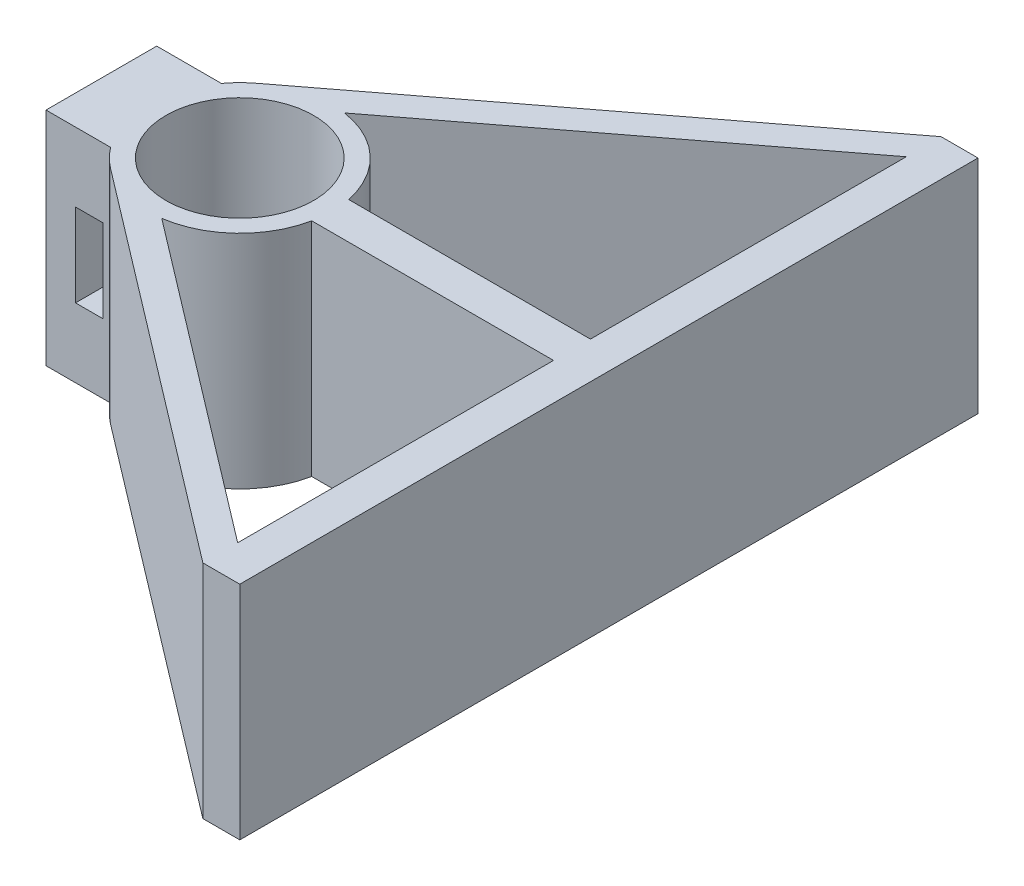
ISO-10303-21;
HEADER;
FILE_DESCRIPTION(('STEP AP214'),'2;1');
FILE_NAME('part.step','',(''),(''),'','','');
FILE_SCHEMA(('AUTOMOTIVE_DESIGN { 1 0 10303 214 1 1 1 1 }'));
ENDSEC;
DATA;
#1=APPLICATION_CONTEXT('core data for automotive mechanical design processes');
#2=APPLICATION_PROTOCOL_DEFINITION('international standard','automotive_design',2000,#1);
#3=PRODUCT_CONTEXT('',#1,'mechanical');
#4=PRODUCT('Part','Part','',(#3));
#5=PRODUCT_RELATED_PRODUCT_CATEGORY('part','',(#4));
#6=PRODUCT_DEFINITION_FORMATION('','',#4);
#7=PRODUCT_DEFINITION_CONTEXT('part definition',#1,'design');
#8=PRODUCT_DEFINITION('design','',#6,#7);
#9=PRODUCT_DEFINITION_SHAPE('','',#8);
#10=(LENGTH_UNIT() NAMED_UNIT(*) SI_UNIT(.MILLI.,.METRE.));
#11=(NAMED_UNIT(*) PLANE_ANGLE_UNIT() SI_UNIT($,.RADIAN.));
#12=(NAMED_UNIT(*) SI_UNIT($,.STERADIAN.) SOLID_ANGLE_UNIT());
#13=UNCERTAINTY_MEASURE_WITH_UNIT(LENGTH_MEASURE(1.E-05),#10,'distance_accuracy_value','');
#14=(GEOMETRIC_REPRESENTATION_CONTEXT(3) GLOBAL_UNCERTAINTY_ASSIGNED_CONTEXT((#13)) GLOBAL_UNIT_ASSIGNED_CONTEXT((#10,
#11,#12)) REPRESENTATION_CONTEXT('',''));
#15=CARTESIAN_POINT('',(0.,0.,0.));
#16=DIRECTION('',(0.,0.,1.));
#17=DIRECTION('',(1.,0.,0.));
#18=AXIS2_PLACEMENT_3D('',#15,#16,#17);
#19=CARTESIAN_POINT('',(0.,-6.,0.));
#20=DIRECTION('',(0.,1.,0.));
#21=DIRECTION('',(0.,0.,1.));
#22=AXIS2_PLACEMENT_3D('',#19,#20,#21);
#23=CYLINDRICAL_SURFACE('',#22,5.);
#24=DIRECTION('',(0.,1.,0.));
#25=VECTOR('',#24,1.);
#26=CARTESIAN_POINT('',(-4.,-6.,-3.));
#27=LINE('',#26,#25);
#28=CARTESIAN_POINT('',(-4.,-6.,-3.));
#29=VERTEX_POINT('',#28);
#30=CARTESIAN_POINT('',(-4.,6.,-3.));
#31=VERTEX_POINT('',#30);
#32=EDGE_CURVE('E42',#29,#31,#27,.T.);
#33=ORIENTED_EDGE('',*,*,#32,.T.);
#34=CARTESIAN_POINT('',(0.,6.,0.));
#35=DIRECTION('',(0.,1.,0.));
#36=DIRECTION('',(0.,0.,1.));
#37=AXIS2_PLACEMENT_3D('',#34,#35,#36);
#38=CIRCLE('',#37,5.);
#39=CARTESIAN_POINT('',(-3.03019449348129,6.,-3.97717504413316));
#40=VERTEX_POINT('',#39);
#41=EDGE_CURVE('E271',#40,#31,#38,.T.);
#42=ORIENTED_EDGE('',*,*,#41,.F.);
#43=DIRECTION('',(0.,1.,0.));
#44=VECTOR('',#43,1.);
#45=CARTESIAN_POINT('',(-3.03019449348129,-6.,-3.97717504413316));
#46=LINE('',#45,#44);
#47=CARTESIAN_POINT('',(-3.03019449348129,-6.,-3.97717504413316));
#48=VERTEX_POINT('',#47);
#49=EDGE_CURVE('E11',#48,#40,#46,.T.);
#50=ORIENTED_EDGE('',*,*,#49,.F.);
#51=CARTESIAN_POINT('',(0.,-6.,0.));
#52=DIRECTION('',(0.,1.,0.));
#53=DIRECTION('',(0.,0.,1.));
#54=AXIS2_PLACEMENT_3D('',#51,#52,#53);
#55=CIRCLE('',#54,5.);
#56=EDGE_CURVE('E371',#48,#29,#55,.T.);
#57=ORIENTED_EDGE('',*,*,#56,.T.);
#58=EDGE_LOOP('',(#33,#42,#50,#57));
#59=FACE_BOUND('',#58,.T.);
#60=ADVANCED_FACE('F39',(#59),#23,.T.);
#61=CARTESIAN_POINT('',(18.,-6.,-20.));
#62=DIRECTION('',(-0.606038898696259,0.,-0.795435008826633));
#63=DIRECTION('',(-0.795435008826633,0.,0.606038898696259));
#64=AXIS2_PLACEMENT_3D('',#61,#62,#63);
#65=PLANE('',#64);
#66=ORIENTED_EDGE('',*,*,#49,.T.);
#67=DIRECTION('',(-0.795435008826633,0.,0.606038898696259));
#68=VECTOR('',#67,1.);
#69=CARTESIAN_POINT('',(18.,6.,-20.));
#70=LINE('',#69,#68);
#71=CARTESIAN_POINT('',(18.,6.,-20.));
#72=VERTEX_POINT('',#71);
#73=EDGE_CURVE('E307',#72,#40,#70,.T.);
#74=ORIENTED_EDGE('',*,*,#73,.F.);
#75=DIRECTION('',(0.,1.,0.));
#76=VECTOR('',#75,1.);
#77=CARTESIAN_POINT('',(18.,-6.,-20.));
#78=LINE('',#77,#76);
#79=CARTESIAN_POINT('',(18.,-6.,-20.));
#80=VERTEX_POINT('',#79);
#81=EDGE_CURVE('E48',#80,#72,#78,.T.);
#82=ORIENTED_EDGE('',*,*,#81,.F.);
#83=DIRECTION('',(-0.795435008826633,0.,0.606038898696259));
#84=VECTOR('',#83,1.);
#85=CARTESIAN_POINT('',(18.,-6.,-20.));
#86=LINE('',#85,#84);
#87=EDGE_CURVE('E406',#80,#48,#86,.T.);
#88=ORIENTED_EDGE('',*,*,#87,.T.);
#89=EDGE_LOOP('',(#66,#74,#82,#88));
#90=FACE_BOUND('',#89,.T.);
#91=ADVANCED_FACE('F444',(#90),#65,.T.);
#92=CARTESIAN_POINT('',(20.,-6.,-20.));
#93=DIRECTION('',(0.,0.,-1.));
#94=DIRECTION('',(-1.,0.,0.));
#95=AXIS2_PLACEMENT_3D('',#92,#93,#94);
#96=PLANE('',#95);
#97=ORIENTED_EDGE('',*,*,#81,.T.);
#98=DIRECTION('',(-1.,0.,0.));
#99=VECTOR('',#98,1.);
#100=CARTESIAN_POINT('',(20.,6.,-20.));
#101=LINE('',#100,#99);
#102=CARTESIAN_POINT('',(20.,6.,-20.));
#103=VERTEX_POINT('',#102);
#104=EDGE_CURVE('E303',#103,#72,#101,.T.);
#105=ORIENTED_EDGE('',*,*,#104,.F.);
#106=DIRECTION('',(0.,1.,0.));
#107=VECTOR('',#106,1.);
#108=CARTESIAN_POINT('',(20.,-6.,-20.));
#109=LINE('',#108,#107);
#110=CARTESIAN_POINT('',(20.,-6.,-20.));
#111=VERTEX_POINT('',#110);
#112=EDGE_CURVE('E412',#111,#103,#109,.T.);
#113=ORIENTED_EDGE('',*,*,#112,.F.);
#114=DIRECTION('',(-1.,0.,0.));
#115=VECTOR('',#114,1.);
#116=CARTESIAN_POINT('',(20.,-6.,-20.));
#117=LINE('',#116,#115);
#118=EDGE_CURVE('E402',#111,#80,#117,.T.);
#119=ORIENTED_EDGE('',*,*,#118,.T.);
#120=EDGE_LOOP('',(#97,#105,#113,#119));
#121=FACE_BOUND('',#120,.T.);
#122=ADVANCED_FACE('F474',(#121),#96,.T.);
#123=CARTESIAN_POINT('',(20.,-6.,1.90555236810274));
#124=DIRECTION('',(1.,0.,0.));
#125=DIRECTION('',(0.,0.,-1.));
#126=AXIS2_PLACEMENT_3D('',#123,#124,#125);
#127=PLANE('',#126);
#128=ORIENTED_EDGE('',*,*,#112,.T.);
#129=DIRECTION('',(0.,0.,-1.));
#130=VECTOR('',#129,1.);
#131=CARTESIAN_POINT('',(20.,6.,1.90555236810274));
#132=LINE('',#131,#130);
#133=CARTESIAN_POINT('',(20.,6.,20.));
#134=VERTEX_POINT('',#133);
#135=EDGE_CURVE('E299',#134,#103,#132,.T.);
#136=ORIENTED_EDGE('',*,*,#135,.F.);
#137=DIRECTION('',(0.,1.,0.));
#138=VECTOR('',#137,1.);
#139=CARTESIAN_POINT('',(20.,-6.,20.));
#140=LINE('',#139,#138);
#141=CARTESIAN_POINT('',(20.,-6.,20.));
#142=VERTEX_POINT('',#141);
#143=EDGE_CURVE('E415',#142,#134,#140,.T.);
#144=ORIENTED_EDGE('',*,*,#143,.F.);
#145=DIRECTION('',(0.,0.,-1.));
#146=VECTOR('',#145,1.);
#147=CARTESIAN_POINT('',(20.,-6.,1.90555236810274));
#148=LINE('',#147,#146);
#149=EDGE_CURVE('E399',#142,#111,#148,.T.);
#150=ORIENTED_EDGE('',*,*,#149,.T.);
#151=EDGE_LOOP('',(#128,#136,#144,#150));
#152=FACE_BOUND('',#151,.T.);
#153=ADVANCED_FACE('F471',(#152),#127,.T.);
#154=CARTESIAN_POINT('',(20.,-6.,20.));
#155=DIRECTION('',(0.,0.,1.));
#156=DIRECTION('',(1.,0.,0.));
#157=AXIS2_PLACEMENT_3D('',#154,#155,#156);
#158=PLANE('',#157);
#159=ORIENTED_EDGE('',*,*,#143,.T.);
#160=DIRECTION('',(1.,0.,0.));
#161=VECTOR('',#160,1.);
#162=CARTESIAN_POINT('',(20.,6.,20.));
#163=LINE('',#162,#161);
#164=CARTESIAN_POINT('',(18.,6.,20.));
#165=VERTEX_POINT('',#164);
#166=EDGE_CURVE('E295',#165,#134,#163,.T.);
#167=ORIENTED_EDGE('',*,*,#166,.F.);
#168=DIRECTION('',(0.,1.,0.));
#169=VECTOR('',#168,1.);
#170=CARTESIAN_POINT('',(18.,-6.,20.));
#171=LINE('',#170,#169);
#172=CARTESIAN_POINT('',(18.,-6.,20.));
#173=VERTEX_POINT('',#172);
#174=EDGE_CURVE('E418',#173,#165,#171,.T.);
#175=ORIENTED_EDGE('',*,*,#174,.F.);
#176=DIRECTION('',(1.,0.,0.));
#177=VECTOR('',#176,1.);
#178=CARTESIAN_POINT('',(20.,-6.,20.));
#179=LINE('',#178,#177);
#180=EDGE_CURVE('E395',#173,#142,#179,.T.);
#181=ORIENTED_EDGE('',*,*,#180,.T.);
#182=EDGE_LOOP('',(#159,#167,#175,#181));
#183=FACE_BOUND('',#182,.T.);
#184=ADVANCED_FACE('F469',(#183),#158,.T.);
#185=CARTESIAN_POINT('',(18.,-6.,20.));
#186=DIRECTION('',(-0.606038898696259,0.,0.795435008826633));
#187=DIRECTION('',(0.795435008826633,0.,0.606038898696259));
#188=AXIS2_PLACEMENT_3D('',#185,#186,#187);
#189=PLANE('',#188);
#190=ORIENTED_EDGE('',*,*,#174,.T.);
#191=DIRECTION('',(0.795435008826633,0.,0.606038898696259));
#192=VECTOR('',#191,1.);
#193=CARTESIAN_POINT('',(18.,6.,20.));
#194=LINE('',#193,#192);
#195=CARTESIAN_POINT('',(-3.03019449348129,6.,3.97717504413316));
#196=VERTEX_POINT('',#195);
#197=EDGE_CURVE('E291',#196,#165,#194,.T.);
#198=ORIENTED_EDGE('',*,*,#197,.F.);
#199=DIRECTION('',(0.,1.,0.));
#200=VECTOR('',#199,1.);
#201=CARTESIAN_POINT('',(-3.03019449348129,-6.,3.97717504413316));
#202=LINE('',#201,#200);
#203=CARTESIAN_POINT('',(-3.03019449348129,-6.,3.97717504413316));
#204=VERTEX_POINT('',#203);
#205=EDGE_CURVE('E421',#204,#196,#202,.T.);
#206=ORIENTED_EDGE('',*,*,#205,.F.);
#207=DIRECTION('',(0.795435008826633,0.,0.606038898696259));
#208=VECTOR('',#207,1.);
#209=CARTESIAN_POINT('',(18.,-6.,20.));
#210=LINE('',#209,#208);
#211=EDGE_CURVE('E391',#204,#173,#210,.T.);
#212=ORIENTED_EDGE('',*,*,#211,.T.);
#213=EDGE_LOOP('',(#190,#198,#206,#212));
#214=FACE_BOUND('',#213,.T.);
#215=ADVANCED_FACE('F464',(#214),#189,.T.);
#216=CARTESIAN_POINT('',(0.,-6.,0.));
#217=DIRECTION('',(0.,1.,0.));
#218=DIRECTION('',(0.,0.,1.));
#219=AXIS2_PLACEMENT_3D('',#216,#217,#218);
#220=CYLINDRICAL_SURFACE('',#219,5.);
#221=ORIENTED_EDGE('',*,*,#205,.T.);
#222=CARTESIAN_POINT('',(0.,6.,0.));
#223=DIRECTION('',(0.,1.,0.));
#224=DIRECTION('',(0.,0.,1.));
#225=AXIS2_PLACEMENT_3D('',#222,#223,#224);
#226=CIRCLE('',#225,5.);
#227=CARTESIAN_POINT('',(-4.,6.,3.));
#228=VERTEX_POINT('',#227);
#229=EDGE_CURVE('E287',#228,#196,#226,.T.);
#230=ORIENTED_EDGE('',*,*,#229,.F.);
#231=DIRECTION('',(0.,1.,0.));
#232=VECTOR('',#231,1.);
#233=CARTESIAN_POINT('',(-4.,-6.,3.));
#234=LINE('',#233,#232);
#235=CARTESIAN_POINT('',(-4.,-6.,3.));
#236=VERTEX_POINT('',#235);
#237=EDGE_CURVE('E424',#236,#228,#234,.T.);
#238=ORIENTED_EDGE('',*,*,#237,.F.);
#239=CARTESIAN_POINT('',(0.,-6.,0.));
#240=DIRECTION('',(0.,1.,0.));
#241=DIRECTION('',(0.,0.,1.));
#242=AXIS2_PLACEMENT_3D('',#239,#240,#241);
#243=CIRCLE('',#242,5.);
#244=EDGE_CURVE('E387',#236,#204,#243,.T.);
#245=ORIENTED_EDGE('',*,*,#244,.T.);
#246=EDGE_LOOP('',(#221,#230,#238,#245));
#247=FACE_BOUND('',#246,.T.);
#248=ADVANCED_FACE('F459',(#247),#220,.T.);
#249=CARTESIAN_POINT('',(-4.,-6.,3.));
#250=DIRECTION('',(0.,0.,1.));
#251=DIRECTION('',(1.,0.,0.));
#252=AXIS2_PLACEMENT_3D('',#249,#250,#251);
#253=PLANE('',#252);
#254=DIRECTION('',(-1.,0.,0.));
#255=VECTOR('',#254,1.);
#256=CARTESIAN_POINT('',(-4.,2.25,3.));
#257=LINE('',#256,#255);
#258=CARTESIAN_POINT('',(-4.4,2.25,3.));
#259=VERTEX_POINT('',#258);
#260=CARTESIAN_POINT('',(-5.9,2.25,3.));
#261=VERTEX_POINT('',#260);
#262=EDGE_CURVE('E232',#259,#261,#257,.T.);
#263=ORIENTED_EDGE('',*,*,#262,.F.);
#264=DIRECTION('',(0.,1.,0.));
#265=VECTOR('',#264,1.);
#266=CARTESIAN_POINT('',(-4.4,-6.,3.));
#267=LINE('',#266,#265);
#268=CARTESIAN_POINT('',(-4.4,-2.25,3.));
#269=VERTEX_POINT('',#268);
#270=EDGE_CURVE('E220',#269,#259,#267,.T.);
#271=ORIENTED_EDGE('',*,*,#270,.F.);
#272=DIRECTION('',(1.,0.,0.));
#273=VECTOR('',#272,1.);
#274=CARTESIAN_POINT('',(-4.,-2.25,3.));
#275=LINE('',#274,#273);
#276=CARTESIAN_POINT('',(-5.9,-2.25,3.));
#277=VERTEX_POINT('',#276);
#278=EDGE_CURVE('E195',#277,#269,#275,.T.);
#279=ORIENTED_EDGE('',*,*,#278,.F.);
#280=DIRECTION('',(0.,-1.,0.));
#281=VECTOR('',#280,1.);
#282=CARTESIAN_POINT('',(-5.9,-6.,3.));
#283=LINE('',#282,#281);
#284=EDGE_CURVE('E229',#261,#277,#283,.T.);
#285=ORIENTED_EDGE('',*,*,#284,.F.);
#286=EDGE_LOOP('',(#263,#271,#279,#285));
#287=FACE_BOUND('',#286,.T.);
#288=ORIENTED_EDGE('',*,*,#237,.T.);
#289=DIRECTION('',(1.,0.,0.));
#290=VECTOR('',#289,1.);
#291=CARTESIAN_POINT('',(-4.,6.,3.));
#292=LINE('',#291,#290);
#293=CARTESIAN_POINT('',(-7.5,6.,3.));
#294=VERTEX_POINT('',#293);
#295=EDGE_CURVE('E283',#294,#228,#292,.T.);
#296=ORIENTED_EDGE('',*,*,#295,.F.);
#297=DIRECTION('',(0.,1.,0.));
#298=VECTOR('',#297,1.);
#299=CARTESIAN_POINT('',(-7.5,-6.,3.));
#300=LINE('',#299,#298);
#301=CARTESIAN_POINT('',(-7.5,-6.,3.));
#302=VERTEX_POINT('',#301);
#303=EDGE_CURVE('E427',#302,#294,#300,.T.);
#304=ORIENTED_EDGE('',*,*,#303,.F.);
#305=DIRECTION('',(1.,0.,0.));
#306=VECTOR('',#305,1.);
#307=CARTESIAN_POINT('',(-4.,-6.,3.));
#308=LINE('',#307,#306);
#309=EDGE_CURVE('E383',#302,#236,#308,.T.);
#310=ORIENTED_EDGE('',*,*,#309,.T.);
#311=EDGE_LOOP('',(#288,#296,#304,#310));
#312=FACE_BOUND('',#311,.T.);
#313=ADVANCED_FACE('F457',(#287,#312),#253,.T.);
#314=CARTESIAN_POINT('',(-7.5,-6.,-3.));
#315=DIRECTION('',(-1.,0.,0.));
#316=DIRECTION('',(0.,0.,1.));
#317=AXIS2_PLACEMENT_3D('',#314,#315,#316);
#318=PLANE('',#317);
#319=ORIENTED_EDGE('',*,*,#303,.T.);
#320=DIRECTION('',(0.,0.,1.));
#321=VECTOR('',#320,1.);
#322=CARTESIAN_POINT('',(-7.5,6.,-3.));
#323=LINE('',#322,#321);
#324=CARTESIAN_POINT('',(-7.5,6.,-3.));
#325=VERTEX_POINT('',#324);
#326=EDGE_CURVE('E279',#325,#294,#323,.T.);
#327=ORIENTED_EDGE('',*,*,#326,.F.);
#328=DIRECTION('',(0.,1.,0.));
#329=VECTOR('',#328,1.);
#330=CARTESIAN_POINT('',(-7.5,-6.,-3.));
#331=LINE('',#330,#329);
#332=CARTESIAN_POINT('',(-7.5,-6.,-3.));
#333=VERTEX_POINT('',#332);
#334=EDGE_CURVE('E429',#333,#325,#331,.T.);
#335=ORIENTED_EDGE('',*,*,#334,.F.);
#336=DIRECTION('',(0.,0.,1.));
#337=VECTOR('',#336,1.);
#338=CARTESIAN_POINT('',(-7.5,-6.,-3.));
#339=LINE('',#338,#337);
#340=EDGE_CURVE('E379',#333,#302,#339,.T.);
#341=ORIENTED_EDGE('',*,*,#340,.T.);
#342=EDGE_LOOP('',(#319,#327,#335,#341));
#343=FACE_BOUND('',#342,.T.);
#344=ADVANCED_FACE('F453',(#343),#318,.T.);
#345=CARTESIAN_POINT('',(-4.,-6.,-3.));
#346=DIRECTION('',(0.,0.,-1.));
#347=DIRECTION('',(-1.,0.,0.));
#348=AXIS2_PLACEMENT_3D('',#345,#346,#347);
#349=PLANE('',#348);
#350=DIRECTION('',(1.,0.,0.));
#351=VECTOR('',#350,1.);
#352=CARTESIAN_POINT('',(-4.4,2.25,-3.));
#353=LINE('',#352,#351);
#354=CARTESIAN_POINT('',(-5.9,2.25,-3.));
#355=VERTEX_POINT('',#354);
#356=CARTESIAN_POINT('',(-4.4,2.25,-3.));
#357=VERTEX_POINT('',#356);
#358=EDGE_CURVE('E64',#355,#357,#353,.T.);
#359=ORIENTED_EDGE('',*,*,#358,.F.);
#360=DIRECTION('',(0.,1.,0.));
#361=VECTOR('',#360,1.);
#362=CARTESIAN_POINT('',(-5.9,2.25,-3.));
#363=LINE('',#362,#361);
#364=CARTESIAN_POINT('',(-5.9,-2.25,-3.));
#365=VERTEX_POINT('',#364);
#366=EDGE_CURVE('E210',#365,#355,#363,.T.);
#367=ORIENTED_EDGE('',*,*,#366,.F.);
#368=DIRECTION('',(-1.,0.,0.));
#369=VECTOR('',#368,1.);
#370=CARTESIAN_POINT('',(-4.4,-2.25,-3.));
#371=LINE('',#370,#369);
#372=CARTESIAN_POINT('',(-4.4,-2.25,-3.));
#373=VERTEX_POINT('',#372);
#374=EDGE_CURVE('E192',#373,#365,#371,.T.);
#375=ORIENTED_EDGE('',*,*,#374,.F.);
#376=DIRECTION('',(0.,-1.,0.));
#377=VECTOR('',#376,1.);
#378=CARTESIAN_POINT('',(-4.4,-2.25,-3.));
#379=LINE('',#378,#377);
#380=EDGE_CURVE('E202',#357,#373,#379,.T.);
#381=ORIENTED_EDGE('',*,*,#380,.F.);
#382=EDGE_LOOP('',(#359,#367,#375,#381));
#383=FACE_BOUND('',#382,.T.);
#384=ORIENTED_EDGE('',*,*,#334,.T.);
#385=DIRECTION('',(-1.,0.,0.));
#386=VECTOR('',#385,1.);
#387=CARTESIAN_POINT('',(-4.,6.,-3.));
#388=LINE('',#387,#386);
#389=EDGE_CURVE('E275',#31,#325,#388,.T.);
#390=ORIENTED_EDGE('',*,*,#389,.F.);
#391=ORIENTED_EDGE('',*,*,#32,.F.);
#392=DIRECTION('',(-1.,0.,0.));
#393=VECTOR('',#392,1.);
#394=CARTESIAN_POINT('',(-4.,-6.,-3.));
#395=LINE('',#394,#393);
#396=EDGE_CURVE('E375',#29,#333,#395,.T.);
#397=ORIENTED_EDGE('',*,*,#396,.T.);
#398=EDGE_LOOP('',(#384,#390,#391,#397));
#399=FACE_BOUND('',#398,.T.);
#400=ADVANCED_FACE('F207',(#383,#399),#349,.T.);
#401=CARTESIAN_POINT('',(0.,-6.,0.));
#402=DIRECTION('',(0.,1.,0.));
#403=DIRECTION('',(0.,0.,1.));
#404=AXIS2_PLACEMENT_3D('',#401,#402,#403);
#405=PLANE('',#404);
#406=DIRECTION('',(-1.,0.,0.));
#407=VECTOR('',#406,1.);
#408=CARTESIAN_POINT('',(4.89897948556636,-6.,0.999999999999999));
#409=LINE('',#408,#407);
#410=CARTESIAN_POINT('',(18.,-6.,1.));
#411=VERTEX_POINT('',#410);
#412=CARTESIAN_POINT('',(4.89897948556636,-6.,0.999999999999999));
#413=VERTEX_POINT('',#412);
#414=EDGE_CURVE('E323',#411,#413,#409,.T.);
#415=ORIENTED_EDGE('',*,*,#414,.T.);
#416=CARTESIAN_POINT('',(0.,-6.,0.));
#417=DIRECTION('',(0.,-1.,0.));
#418=DIRECTION('',(0.,0.,1.));
#419=AXIS2_PLACEMENT_3D('',#416,#417,#418);
#420=CIRCLE('',#419,5.);
#421=CARTESIAN_POINT('',(0.719134947109476,-6.,4.94801424086935));
#422=VERTEX_POINT('',#421);
#423=EDGE_CURVE('E311',#413,#422,#420,.T.);
#424=ORIENTED_EDGE('',*,*,#423,.T.);
#425=DIRECTION('',(0.795435008826633,0.,0.606038898696259));
#426=VECTOR('',#425,1.);
#427=CARTESIAN_POINT('',(18.,-6.,18.1142393993788));
#428=LINE('',#427,#426);
#429=CARTESIAN_POINT('',(18.,-6.,18.1142393993789));
#430=VERTEX_POINT('',#429);
#431=EDGE_CURVE('E315',#422,#430,#428,.T.);
#432=ORIENTED_EDGE('',*,*,#431,.T.);
#433=DIRECTION('',(0.,0.,-1.));
#434=VECTOR('',#433,1.);
#435=CARTESIAN_POINT('',(18.,-6.,1.));
#436=LINE('',#435,#434);
#437=EDGE_CURVE('E319',#430,#411,#436,.T.);
#438=ORIENTED_EDGE('',*,*,#437,.T.);
#439=EDGE_LOOP('',(#415,#424,#432,#438));
#440=FACE_BOUND('',#439,.T.);
#441=DIRECTION('',(-0.795435008826633,0.,0.606038898696259));
#442=VECTOR('',#441,1.);
#443=CARTESIAN_POINT('',(18.,-6.,-18.1142393993789));
#444=LINE('',#443,#442);
#445=CARTESIAN_POINT('',(18.,-6.,-18.1142393993789));
#446=VERTEX_POINT('',#445);
#447=CARTESIAN_POINT('',(0.719134947109474,-6.,-4.94801424086935));
#448=VERTEX_POINT('',#447);
#449=EDGE_CURVE('E351',#446,#448,#444,.T.);
#450=ORIENTED_EDGE('',*,*,#449,.T.);
#451=CARTESIAN_POINT('',(0.,-6.,0.));
#452=DIRECTION('',(0.,-1.,0.));
#453=DIRECTION('',(0.,0.,1.));
#454=AXIS2_PLACEMENT_3D('',#451,#452,#453);
#455=CIRCLE('',#454,5.);
#456=CARTESIAN_POINT('',(4.89897948556636,-6.,-1.));
#457=VERTEX_POINT('',#456);
#458=EDGE_CURVE('E331',#448,#457,#455,.T.);
#459=ORIENTED_EDGE('',*,*,#458,.T.);
#460=DIRECTION('',(1.,0.,0.));
#461=VECTOR('',#460,1.);
#462=CARTESIAN_POINT('',(4.89897948556636,-6.,-1.));
#463=LINE('',#462,#461);
#464=CARTESIAN_POINT('',(18.,-6.,-1.));
#465=VERTEX_POINT('',#464);
#466=EDGE_CURVE('E343',#457,#465,#463,.T.);
#467=ORIENTED_EDGE('',*,*,#466,.T.);
#468=DIRECTION('',(0.,0.,-1.));
#469=VECTOR('',#468,1.);
#470=CARTESIAN_POINT('',(18.,-6.,-1.));
#471=LINE('',#470,#469);
#472=EDGE_CURVE('E347',#465,#446,#471,.T.);
#473=ORIENTED_EDGE('',*,*,#472,.T.);
#474=EDGE_LOOP('',(#450,#459,#467,#473));
#475=FACE_BOUND('',#474,.T.);
#476=CARTESIAN_POINT('',(0.,-6.,0.));
#477=DIRECTION('',(0.,1.,0.));
#478=DIRECTION('',(0.,0.,1.));
#479=AXIS2_PLACEMENT_3D('',#476,#477,#478);
#480=CIRCLE('',#479,4.);
#481=CARTESIAN_POINT('',(0.,-6.,4.));
#482=VERTEX_POINT('',#481);
#483=EDGE_CURVE('E359',#482,#482,#480,.T.);
#484=ORIENTED_EDGE('',*,*,#483,.T.);
#485=EDGE_LOOP('',(#484));
#486=FACE_BOUND('',#485,.T.);
#487=ORIENTED_EDGE('',*,*,#56,.F.);
#488=ORIENTED_EDGE('',*,*,#87,.F.);
#489=ORIENTED_EDGE('',*,*,#118,.F.);
#490=ORIENTED_EDGE('',*,*,#149,.F.);
#491=ORIENTED_EDGE('',*,*,#180,.F.);
#492=ORIENTED_EDGE('',*,*,#211,.F.);
#493=ORIENTED_EDGE('',*,*,#244,.F.);
#494=ORIENTED_EDGE('',*,*,#309,.F.);
#495=ORIENTED_EDGE('',*,*,#340,.F.);
#496=ORIENTED_EDGE('',*,*,#396,.F.);
#497=EDGE_LOOP('',(#487,#488,#489,#490,#491,#492,#493,#494,#495,#496));
#498=FACE_BOUND('',#497,.T.);
#499=ADVANCED_FACE('F447',(#440,#475,#486,#498),#405,.F.);
#500=CARTESIAN_POINT('',(0.,-6.,0.));
#501=DIRECTION('',(0.,1.,0.));
#502=DIRECTION('',(0.,0.,1.));
#503=AXIS2_PLACEMENT_3D('',#500,#501,#502);
#504=CYLINDRICAL_SURFACE('',#503,4.);
#505=ORIENTED_EDGE('',*,*,#483,.F.);
#506=EDGE_LOOP('',(#505));
#507=FACE_BOUND('',#506,.T.);
#508=CARTESIAN_POINT('',(0.,6.,0.));
#509=DIRECTION('',(0.,1.,0.));
#510=DIRECTION('',(0.,0.,1.));
#511=AXIS2_PLACEMENT_3D('',#508,#509,#510);
#512=CIRCLE('',#511,4.);
#513=CARTESIAN_POINT('',(0.,6.,4.));
#514=VERTEX_POINT('',#513);
#515=EDGE_CURVE('E267',#514,#514,#512,.T.);
#516=ORIENTED_EDGE('',*,*,#515,.T.);
#517=EDGE_LOOP('',(#516));
#518=FACE_BOUND('',#517,.T.);
#519=ADVANCED_FACE('F546',(#507,#518),#504,.F.);
#520=CARTESIAN_POINT('',(0.,-6.,0.));
#521=DIRECTION('',(0.,1.,0.));
#522=DIRECTION('',(0.,0.,1.));
#523=AXIS2_PLACEMENT_3D('',#520,#521,#522);
#524=CYLINDRICAL_SURFACE('',#523,5.);
#525=DIRECTION('',(0.,1.,0.));
#526=VECTOR('',#525,1.);
#527=CARTESIAN_POINT('',(0.719134947109474,-6.,-4.94801424086935));
#528=LINE('',#527,#526);
#529=CARTESIAN_POINT('',(0.719134947109474,6.,-4.94801424086935));
#530=VERTEX_POINT('',#529);
#531=EDGE_CURVE('E356',#448,#530,#528,.T.);
#532=ORIENTED_EDGE('',*,*,#531,.T.);
#533=CARTESIAN_POINT('',(0.,6.,0.));
#534=DIRECTION('',(0.,-1.,0.));
#535=DIRECTION('',(0.,0.,1.));
#536=AXIS2_PLACEMENT_3D('',#533,#534,#535);
#537=CIRCLE('',#536,5.);
#538=CARTESIAN_POINT('',(4.89897948556636,6.,-1.));
#539=VERTEX_POINT('',#538);
#540=EDGE_CURVE('E251',#530,#539,#537,.T.);
#541=ORIENTED_EDGE('',*,*,#540,.T.);
#542=DIRECTION('',(0.,1.,0.));
#543=VECTOR('',#542,1.);
#544=CARTESIAN_POINT('',(4.89897948556636,-6.,-1.));
#545=LINE('',#544,#543);
#546=EDGE_CURVE('E355',#457,#539,#545,.T.);
#547=ORIENTED_EDGE('',*,*,#546,.F.);
#548=ORIENTED_EDGE('',*,*,#458,.F.);
#549=EDGE_LOOP('',(#532,#541,#547,#548));
#550=FACE_BOUND('',#549,.T.);
#551=ADVANCED_FACE('F556',(#550),#524,.T.);
#552=CARTESIAN_POINT('',(18.,-6.,-18.1142393993789));
#553=DIRECTION('',(-0.606038898696259,0.,-0.795435008826633));
#554=DIRECTION('',(-0.795435008826633,0.,0.606038898696259));
#555=AXIS2_PLACEMENT_3D('',#552,#553,#554);
#556=PLANE('',#555);
#557=DIRECTION('',(0.,1.,0.));
#558=VECTOR('',#557,1.);
#559=CARTESIAN_POINT('',(18.,-6.,-18.1142393993789));
#560=LINE('',#559,#558);
#561=CARTESIAN_POINT('',(18.,6.,-18.1142393993789));
#562=VERTEX_POINT('',#561);
#563=EDGE_CURVE('E360',#446,#562,#560,.T.);
#564=ORIENTED_EDGE('',*,*,#563,.T.);
#565=DIRECTION('',(-0.795435008826633,0.,0.606038898696259));
#566=VECTOR('',#565,1.);
#567=CARTESIAN_POINT('',(18.,6.,-18.1142393993789));
#568=LINE('',#567,#566);
#569=EDGE_CURVE('E263',#562,#530,#568,.T.);
#570=ORIENTED_EDGE('',*,*,#569,.T.);
#571=ORIENTED_EDGE('',*,*,#531,.F.);
#572=ORIENTED_EDGE('',*,*,#449,.F.);
#573=EDGE_LOOP('',(#564,#570,#571,#572));
#574=FACE_BOUND('',#573,.T.);
#575=ADVANCED_FACE('F566',(#574),#556,.F.);
#576=CARTESIAN_POINT('',(18.,-6.,-1.));
#577=DIRECTION('',(1.,0.,0.));
#578=DIRECTION('',(0.,0.,-1.));
#579=AXIS2_PLACEMENT_3D('',#576,#577,#578);
#580=PLANE('',#579);
#581=DIRECTION('',(0.,1.,0.));
#582=VECTOR('',#581,1.);
#583=CARTESIAN_POINT('',(18.,-6.,-1.));
#584=LINE('',#583,#582);
#585=CARTESIAN_POINT('',(18.,6.,-1.));
#586=VERTEX_POINT('',#585);
#587=EDGE_CURVE('E363',#465,#586,#584,.T.);
#588=ORIENTED_EDGE('',*,*,#587,.T.);
#589=DIRECTION('',(0.,0.,-1.));
#590=VECTOR('',#589,1.);
#591=CARTESIAN_POINT('',(18.,6.,-1.));
#592=LINE('',#591,#590);
#593=EDGE_CURVE('E259',#586,#562,#592,.T.);
#594=ORIENTED_EDGE('',*,*,#593,.T.);
#595=ORIENTED_EDGE('',*,*,#563,.F.);
#596=ORIENTED_EDGE('',*,*,#472,.F.);
#597=EDGE_LOOP('',(#588,#594,#595,#596));
#598=FACE_BOUND('',#597,.T.);
#599=ADVANCED_FACE('F576',(#598),#580,.F.);
#600=CARTESIAN_POINT('',(4.89897948556636,-6.,-1.));
#601=DIRECTION('',(0.,0.,1.));
#602=DIRECTION('',(1.,0.,0.));
#603=AXIS2_PLACEMENT_3D('',#600,#601,#602);
#604=PLANE('',#603);
#605=ORIENTED_EDGE('',*,*,#546,.T.);
#606=DIRECTION('',(1.,0.,0.));
#607=VECTOR('',#606,1.);
#608=CARTESIAN_POINT('',(4.89897948556636,6.,-1.));
#609=LINE('',#608,#607);
#610=EDGE_CURVE('E255',#539,#586,#609,.T.);
#611=ORIENTED_EDGE('',*,*,#610,.T.);
#612=ORIENTED_EDGE('',*,*,#587,.F.);
#613=ORIENTED_EDGE('',*,*,#466,.F.);
#614=EDGE_LOOP('',(#605,#611,#612,#613));
#615=FACE_BOUND('',#614,.T.);
#616=ADVANCED_FACE('F586',(#615),#604,.F.);
#617=CARTESIAN_POINT('',(0.,-6.,0.));
#618=DIRECTION('',(0.,1.,0.));
#619=DIRECTION('',(0.,0.,1.));
#620=AXIS2_PLACEMENT_3D('',#617,#618,#619);
#621=CYLINDRICAL_SURFACE('',#620,5.);
#622=DIRECTION('',(0.,1.,0.));
#623=VECTOR('',#622,1.);
#624=CARTESIAN_POINT('',(4.89897948556636,-6.,0.999999999999999));
#625=LINE('',#624,#623);
#626=CARTESIAN_POINT('',(4.89897948556636,6.,0.999999999999999));
#627=VERTEX_POINT('',#626);
#628=EDGE_CURVE('E328',#413,#627,#625,.T.);
#629=ORIENTED_EDGE('',*,*,#628,.T.);
#630=CARTESIAN_POINT('',(0.,6.,0.));
#631=DIRECTION('',(0.,-1.,0.));
#632=DIRECTION('',(0.,0.,1.));
#633=AXIS2_PLACEMENT_3D('',#630,#631,#632);
#634=CIRCLE('',#633,5.);
#635=CARTESIAN_POINT('',(0.719134947109476,6.,4.94801424086935));
#636=VERTEX_POINT('',#635);
#637=EDGE_CURVE('E235',#627,#636,#634,.T.);
#638=ORIENTED_EDGE('',*,*,#637,.T.);
#639=DIRECTION('',(0.,1.,0.));
#640=VECTOR('',#639,1.);
#641=CARTESIAN_POINT('',(0.719134947109476,-6.,4.94801424086935));
#642=LINE('',#641,#640);
#643=EDGE_CURVE('E327',#422,#636,#642,.T.);
#644=ORIENTED_EDGE('',*,*,#643,.F.);
#645=ORIENTED_EDGE('',*,*,#423,.F.);
#646=EDGE_LOOP('',(#629,#638,#644,#645));
#647=FACE_BOUND('',#646,.T.);
#648=ADVANCED_FACE('F596',(#647),#621,.T.);
#649=CARTESIAN_POINT('',(4.89897948556636,-6.,0.999999999999999));
#650=DIRECTION('',(0.,0.,-1.));
#651=DIRECTION('',(-1.,0.,0.));
#652=AXIS2_PLACEMENT_3D('',#649,#650,#651);
#653=PLANE('',#652);
#654=DIRECTION('',(0.,1.,0.));
#655=VECTOR('',#654,1.);
#656=CARTESIAN_POINT('',(18.,-6.,1.));
#657=LINE('',#656,#655);
#658=CARTESIAN_POINT('',(18.,6.,1.));
#659=VERTEX_POINT('',#658);
#660=EDGE_CURVE('E332',#411,#659,#657,.T.);
#661=ORIENTED_EDGE('',*,*,#660,.T.);
#662=DIRECTION('',(-1.,0.,0.));
#663=VECTOR('',#662,1.);
#664=CARTESIAN_POINT('',(4.89897948556636,6.,0.999999999999999));
#665=LINE('',#664,#663);
#666=EDGE_CURVE('E247',#659,#627,#665,.T.);
#667=ORIENTED_EDGE('',*,*,#666,.T.);
#668=ORIENTED_EDGE('',*,*,#628,.F.);
#669=ORIENTED_EDGE('',*,*,#414,.F.);
#670=EDGE_LOOP('',(#661,#667,#668,#669));
#671=FACE_BOUND('',#670,.T.);
#672=ADVANCED_FACE('F606',(#671),#653,.F.);
#673=CARTESIAN_POINT('',(18.,-6.,1.));
#674=DIRECTION('',(1.,0.,0.));
#675=DIRECTION('',(0.,0.,-1.));
#676=AXIS2_PLACEMENT_3D('',#673,#674,#675);
#677=PLANE('',#676);
#678=DIRECTION('',(0.,1.,0.));
#679=VECTOR('',#678,1.);
#680=CARTESIAN_POINT('',(18.,-6.,18.1142393993788));
#681=LINE('',#680,#679);
#682=CARTESIAN_POINT('',(18.,6.,18.1142393993788));
#683=VERTEX_POINT('',#682);
#684=EDGE_CURVE('E335',#430,#683,#681,.T.);
#685=ORIENTED_EDGE('',*,*,#684,.T.);
#686=DIRECTION('',(0.,0.,-1.));
#687=VECTOR('',#686,1.);
#688=CARTESIAN_POINT('',(18.,6.,1.));
#689=LINE('',#688,#687);
#690=EDGE_CURVE('E243',#683,#659,#689,.T.);
#691=ORIENTED_EDGE('',*,*,#690,.T.);
#692=ORIENTED_EDGE('',*,*,#660,.F.);
#693=ORIENTED_EDGE('',*,*,#437,.F.);
#694=EDGE_LOOP('',(#685,#691,#692,#693));
#695=FACE_BOUND('',#694,.T.);
#696=ADVANCED_FACE('F616',(#695),#677,.F.);
#697=CARTESIAN_POINT('',(18.,-6.,18.1142393993788));
#698=DIRECTION('',(-0.606038898696259,0.,0.795435008826633));
#699=DIRECTION('',(0.795435008826633,0.,0.606038898696259));
#700=AXIS2_PLACEMENT_3D('',#697,#698,#699);
#701=PLANE('',#700);
#702=ORIENTED_EDGE('',*,*,#643,.T.);
#703=DIRECTION('',(0.795435008826633,0.,0.606038898696259));
#704=VECTOR('',#703,1.);
#705=CARTESIAN_POINT('',(18.,6.,18.1142393993788));
#706=LINE('',#705,#704);
#707=EDGE_CURVE('E239',#636,#683,#706,.T.);
#708=ORIENTED_EDGE('',*,*,#707,.T.);
#709=ORIENTED_EDGE('',*,*,#684,.F.);
#710=ORIENTED_EDGE('',*,*,#431,.F.);
#711=EDGE_LOOP('',(#702,#708,#709,#710));
#712=FACE_BOUND('',#711,.T.);
#713=ADVANCED_FACE('F626',(#712),#701,.F.);
#714=CARTESIAN_POINT('',(0.,6.,0.));
#715=DIRECTION('',(0.,1.,0.));
#716=DIRECTION('',(0.,0.,1.));
#717=AXIS2_PLACEMENT_3D('',#714,#715,#716);
#718=PLANE('',#717);
#719=ORIENTED_EDGE('',*,*,#41,.T.);
#720=ORIENTED_EDGE('',*,*,#389,.T.);
#721=ORIENTED_EDGE('',*,*,#326,.T.);
#722=ORIENTED_EDGE('',*,*,#295,.T.);
#723=ORIENTED_EDGE('',*,*,#229,.T.);
#724=ORIENTED_EDGE('',*,*,#197,.T.);
#725=ORIENTED_EDGE('',*,*,#166,.T.);
#726=ORIENTED_EDGE('',*,*,#135,.T.);
#727=ORIENTED_EDGE('',*,*,#104,.T.);
#728=ORIENTED_EDGE('',*,*,#73,.T.);
#729=EDGE_LOOP('',(#719,#720,#721,#722,#723,#724,#725,#726,#727,#728));
#730=FACE_BOUND('',#729,.T.);
#731=ORIENTED_EDGE('',*,*,#515,.F.);
#732=EDGE_LOOP('',(#731));
#733=FACE_BOUND('',#732,.T.);
#734=ORIENTED_EDGE('',*,*,#610,.F.);
#735=ORIENTED_EDGE('',*,*,#540,.F.);
#736=ORIENTED_EDGE('',*,*,#569,.F.);
#737=ORIENTED_EDGE('',*,*,#593,.F.);
#738=EDGE_LOOP('',(#734,#735,#736,#737));
#739=FACE_BOUND('',#738,.T.);
#740=ORIENTED_EDGE('',*,*,#707,.F.);
#741=ORIENTED_EDGE('',*,*,#637,.F.);
#742=ORIENTED_EDGE('',*,*,#666,.F.);
#743=ORIENTED_EDGE('',*,*,#690,.F.);
#744=EDGE_LOOP('',(#740,#741,#742,#743));
#745=FACE_BOUND('',#744,.T.);
#746=ADVANCED_FACE('F439',(#730,#733,#739,#745),#718,.T.);
#747=CARTESIAN_POINT('',(-4.4,2.25,20.));
#748=DIRECTION('',(0.,1.,0.));
#749=DIRECTION('',(0.,0.,1.));
#750=AXIS2_PLACEMENT_3D('',#747,#748,#749);
#751=PLANE('',#750);
#752=ORIENTED_EDGE('',*,*,#262,.T.);
#753=DIRECTION('',(0.,0.,-1.));
#754=VECTOR('',#753,1.);
#755=CARTESIAN_POINT('',(-5.89999999999999,2.25,20.));
#756=LINE('',#755,#754);
#757=EDGE_CURVE('E217',#261,#355,#756,.T.);
#758=ORIENTED_EDGE('',*,*,#757,.T.);
#759=ORIENTED_EDGE('',*,*,#358,.T.);
#760=DIRECTION('',(0.,0.,-1.));
#761=VECTOR('',#760,1.);
#762=CARTESIAN_POINT('',(-4.4,2.25,20.));
#763=LINE('',#762,#761);
#764=EDGE_CURVE('E199',#259,#357,#763,.T.);
#765=ORIENTED_EDGE('',*,*,#764,.F.);
#766=EDGE_LOOP('',(#752,#758,#759,#765));
#767=FACE_BOUND('',#766,.T.);
#768=ADVANCED_FACE('F645',(#767),#751,.F.);
#769=CARTESIAN_POINT('',(-5.89999999999999,2.25,20.));
#770=DIRECTION('',(-1.,0.,0.));
#771=DIRECTION('',(0.,0.,1.));
#772=AXIS2_PLACEMENT_3D('',#769,#770,#771);
#773=PLANE('',#772);
#774=ORIENTED_EDGE('',*,*,#284,.T.);
#775=DIRECTION('',(0.,0.,-1.));
#776=VECTOR('',#775,1.);
#777=CARTESIAN_POINT('',(-5.9,-2.25,20.));
#778=LINE('',#777,#776);
#779=EDGE_CURVE('E198',#277,#365,#778,.T.);
#780=ORIENTED_EDGE('',*,*,#779,.T.);
#781=ORIENTED_EDGE('',*,*,#366,.T.);
#782=ORIENTED_EDGE('',*,*,#757,.F.);
#783=EDGE_LOOP('',(#774,#780,#781,#782));
#784=FACE_BOUND('',#783,.T.);
#785=ADVANCED_FACE('F666',(#784),#773,.F.);
#786=CARTESIAN_POINT('',(-4.4,-2.25,20.));
#787=DIRECTION('',(0.,-1.,0.));
#788=DIRECTION('',(0.,0.,-1.));
#789=AXIS2_PLACEMENT_3D('',#786,#787,#788);
#790=PLANE('',#789);
#791=ORIENTED_EDGE('',*,*,#278,.T.);
#792=DIRECTION('',(0.,0.,-1.));
#793=VECTOR('',#792,1.);
#794=CARTESIAN_POINT('',(-4.4,-2.25,20.));
#795=LINE('',#794,#793);
#796=EDGE_CURVE('E56',#269,#373,#795,.T.);
#797=ORIENTED_EDGE('',*,*,#796,.T.);
#798=ORIENTED_EDGE('',*,*,#374,.T.);
#799=ORIENTED_EDGE('',*,*,#779,.F.);
#800=EDGE_LOOP('',(#791,#797,#798,#799));
#801=FACE_BOUND('',#800,.T.);
#802=ADVANCED_FACE('F189',(#801),#790,.F.);
#803=CARTESIAN_POINT('',(-4.4,-2.25,20.));
#804=DIRECTION('',(1.,0.,0.));
#805=DIRECTION('',(0.,0.,-1.));
#806=AXIS2_PLACEMENT_3D('',#803,#804,#805);
#807=PLANE('',#806);
#808=ORIENTED_EDGE('',*,*,#270,.T.);
#809=ORIENTED_EDGE('',*,*,#764,.T.);
#810=ORIENTED_EDGE('',*,*,#380,.T.);
#811=ORIENTED_EDGE('',*,*,#796,.F.);
#812=EDGE_LOOP('',(#808,#809,#810,#811));
#813=FACE_BOUND('',#812,.T.);
#814=ADVANCED_FACE('F203',(#813),#807,.F.);
#815=CLOSED_SHELL('',(#60,#91,#122,#153,#184,#215,#248,#313,#344,#400,#499,#519,#551,#575,#599,
#616,#648,#672,#696,#713,#746,#768,#785,#802,#814));
#816=MANIFOLD_SOLID_BREP('B2',#815);
#817=ADVANCED_BREP_SHAPE_REPRESENTATION('',(#18,#816),#14);
#818=SHAPE_DEFINITION_REPRESENTATION(#9,#817);
ENDSEC;
END-ISO-10303-21;
